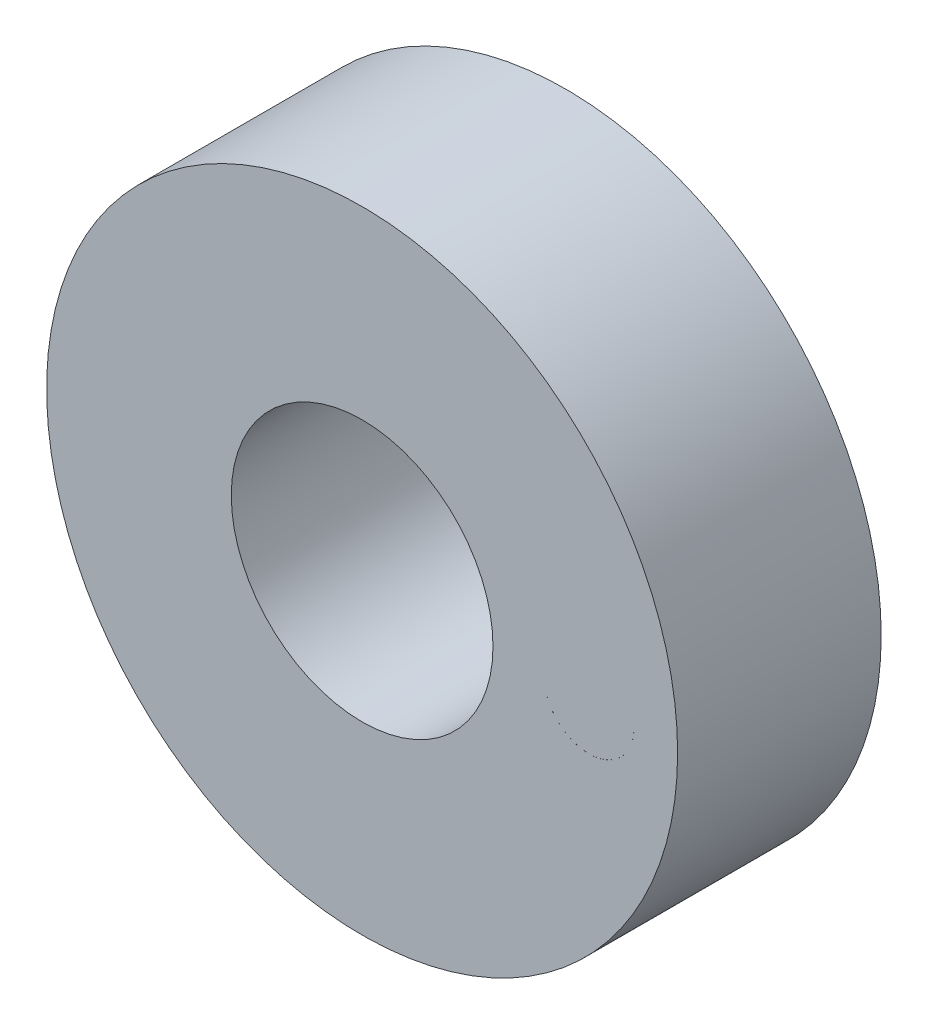
ISO-10303-21;
HEADER;
FILE_DESCRIPTION(('STEP AP214'),'2;1');
FILE_NAME('part.step','',(''),(''),'','','');
FILE_SCHEMA(('AUTOMOTIVE_DESIGN { 1 0 10303 214 1 1 1 1 }'));
ENDSEC;
DATA;
#1=APPLICATION_CONTEXT('core data for automotive mechanical design processes');
#2=APPLICATION_PROTOCOL_DEFINITION('international standard','automotive_design',2000,#1);
#3=PRODUCT_CONTEXT('',#1,'mechanical');
#4=PRODUCT('Part','Part','',(#3));
#5=PRODUCT_RELATED_PRODUCT_CATEGORY('part','',(#4));
#6=PRODUCT_DEFINITION_FORMATION('','',#4);
#7=PRODUCT_DEFINITION_CONTEXT('part definition',#1,'design');
#8=PRODUCT_DEFINITION('design','',#6,#7);
#9=PRODUCT_DEFINITION_SHAPE('','',#8);
#10=(LENGTH_UNIT() NAMED_UNIT(*) SI_UNIT(.MILLI.,.METRE.));
#11=(NAMED_UNIT(*) PLANE_ANGLE_UNIT() SI_UNIT($,.RADIAN.));
#12=(NAMED_UNIT(*) SI_UNIT($,.STERADIAN.) SOLID_ANGLE_UNIT());
#13=UNCERTAINTY_MEASURE_WITH_UNIT(LENGTH_MEASURE(1.E-05),#10,'distance_accuracy_value','');
#14=(GEOMETRIC_REPRESENTATION_CONTEXT(3) GLOBAL_UNCERTAINTY_ASSIGNED_CONTEXT((#13)) GLOBAL_UNIT_ASSIGNED_CONTEXT((#10,
#11,#12)) REPRESENTATION_CONTEXT('',''));
#15=CARTESIAN_POINT('',(0.,0.,0.));
#16=DIRECTION('',(0.,0.,1.));
#17=DIRECTION('',(1.,0.,0.));
#18=AXIS2_PLACEMENT_3D('',#15,#16,#17);
#19=CARTESIAN_POINT('',(0.,-7.79999999999999,7.));
#20=DIRECTION('',(0.,0.,-1.));
#21=DIRECTION('',(-1.,0.,0.));
#22=AXIS2_PLACEMENT_3D('',#19,#20,#21);
#23=CYLINDRICAL_SURFACE('',#22,1.54999999999988);
#24=CARTESIAN_POINT('',(0.,-7.79999999999999,0.));
#25=DIRECTION('',(0.,0.,1.));
#26=DIRECTION('',(1.,0.,0.));
#27=AXIS2_PLACEMENT_3D('',#24,#25,#26);
#28=CIRCLE('',#27,1.54999999999988);
#29=CARTESIAN_POINT('',(1.54999999999984,-7.79999999999999,0.));
#30=VERTEX_POINT('',#29);
#31=EDGE_CURVE('E94',#30,#30,#28,.T.);
#32=ORIENTED_EDGE('',*,*,#31,.F.);
#33=EDGE_LOOP('',(#32));
#34=FACE_BOUND('',#33,.T.);
#35=CARTESIAN_POINT('',(0.,-7.79999999999999,4.));
#36=DIRECTION('',(0.,0.,1.));
#37=DIRECTION('',(1.,0.,0.));
#38=AXIS2_PLACEMENT_3D('',#35,#36,#37);
#39=CIRCLE('',#38,1.54999999999988);
#40=CARTESIAN_POINT('',(1.54999999999984,-7.79999999999999,4.));
#41=VERTEX_POINT('',#40);
#42=EDGE_CURVE('E165',#41,#41,#39,.T.);
#43=ORIENTED_EDGE('',*,*,#42,.T.);
#44=EDGE_LOOP('',(#43));
#45=FACE_BOUND('',#44,.T.);
#46=ADVANCED_FACE('F45',(#34,#45),#23,.F.);
#47=CARTESIAN_POINT('',(-7.80000000000021,2.56630654227319E-13,7.));
#48=DIRECTION('',(0.,0.,-1.));
#49=DIRECTION('',(-1.,0.,0.));
#50=AXIS2_PLACEMENT_3D('',#47,#48,#49);
#51=CYLINDRICAL_SURFACE('',#50,1.55);
#52=CARTESIAN_POINT('',(-7.80000000000021,2.56630654227319E-13,0.));
#53=DIRECTION('',(0.,0.,1.));
#54=DIRECTION('',(1.,0.,0.));
#55=AXIS2_PLACEMENT_3D('',#52,#53,#54);
#56=CIRCLE('',#55,1.55);
#57=CARTESIAN_POINT('',(-6.25000000000021,2.56630654227319E-13,0.));
#58=VERTEX_POINT('',#57);
#59=EDGE_CURVE('E91',#58,#58,#56,.T.);
#60=ORIENTED_EDGE('',*,*,#59,.F.);
#61=EDGE_LOOP('',(#60));
#62=FACE_BOUND('',#61,.T.);
#63=CARTESIAN_POINT('',(-7.80000000000023,2.50667542278649E-13,4.));
#64=DIRECTION('',(0.,0.,1.));
#65=DIRECTION('',(1.,0.,0.));
#66=AXIS2_PLACEMENT_3D('',#63,#64,#65);
#67=CIRCLE('',#66,1.55);
#68=CARTESIAN_POINT('',(-6.25000000000023,2.50667542278649E-13,4.));
#69=VERTEX_POINT('',#68);
#70=EDGE_CURVE('E167',#69,#69,#67,.T.);
#71=ORIENTED_EDGE('',*,*,#70,.T.);
#72=EDGE_LOOP('',(#71));
#73=FACE_BOUND('',#72,.T.);
#74=ADVANCED_FACE('F139',(#62,#73),#51,.F.);
#75=CARTESIAN_POINT('',(0.,7.80000000000043,7.));
#76=DIRECTION('',(0.,0.,-1.));
#77=DIRECTION('',(-1.,0.,0.));
#78=AXIS2_PLACEMENT_3D('',#75,#76,#77);
#79=CYLINDRICAL_SURFACE('',#78,1.55000000000028);
#80=CARTESIAN_POINT('',(0.,7.80000000000043,0.));
#81=DIRECTION('',(0.,0.,1.));
#82=DIRECTION('',(1.,0.,0.));
#83=AXIS2_PLACEMENT_3D('',#80,#81,#82);
#84=CIRCLE('',#83,1.55000000000028);
#85=CARTESIAN_POINT('',(1.55000000000032,7.80000000000043,0.));
#86=VERTEX_POINT('',#85);
#87=EDGE_CURVE('E88',#86,#86,#84,.T.);
#88=ORIENTED_EDGE('',*,*,#87,.F.);
#89=EDGE_LOOP('',(#88));
#90=FACE_BOUND('',#89,.T.);
#91=CARTESIAN_POINT('',(0.,7.80000000000043,4.));
#92=DIRECTION('',(0.,0.,1.));
#93=DIRECTION('',(1.,0.,0.));
#94=AXIS2_PLACEMENT_3D('',#91,#92,#93);
#95=CIRCLE('',#94,1.55000000000028);
#96=CARTESIAN_POINT('',(1.55000000000032,7.80000000000043,4.));
#97=VERTEX_POINT('',#96);
#98=EDGE_CURVE('E99',#97,#97,#95,.T.);
#99=ORIENTED_EDGE('',*,*,#98,.T.);
#100=EDGE_LOOP('',(#99));
#101=FACE_BOUND('',#100,.T.);
#102=ADVANCED_FACE('F136',(#90,#101),#79,.F.);
#103=CARTESIAN_POINT('',(0.,0.,7.));
#104=DIRECTION('',(0.,0.,1.));
#105=DIRECTION('',(1.,0.,0.));
#106=AXIS2_PLACEMENT_3D('',#103,#104,#105);
#107=PLANE('',#106);
#108=CARTESIAN_POINT('',(7.80000000000021,1.84487063980702E-13,7.));
#109=DIRECTION('',(0.,0.,1.));
#110=DIRECTION('',(1.,0.,0.));
#111=AXIS2_PLACEMENT_3D('',#108,#109,#110);
#112=CIRCLE('',#111,1.55000000000015);
#113=CARTESIAN_POINT('',(6.25000017357694,0.000733545011808529,7.));
#114=VERTEX_POINT('',#113);
#115=CARTESIAN_POINT('',(9.34999974137716,0.000895394798641488,7.));
#116=VERTEX_POINT('',#115);
#117=EDGE_CURVE('E49',#114,#116,#112,.T.);
#118=ORIENTED_EDGE('',*,*,#117,.F.);
#119=CARTESIAN_POINT('',(7.79999991495389,0.00162893978756899,7.));
#120=DIRECTION('',(0.,0.,1.));
#121=DIRECTION('',(1.,0.,0.));
#122=AXIS2_PLACEMENT_3D('',#119,#120,#121);
#123=CIRCLE('',#122,1.55000000000013);
#124=EDGE_CURVE('E74',#114,#116,#123,.T.);
#125=ORIENTED_EDGE('',*,*,#124,.T.);
#126=EDGE_LOOP('',(#118,#125));
#127=FACE_BOUND('',#126,.T.);
#128=CARTESIAN_POINT('',(0.,0.,7.));
#129=DIRECTION('',(0.,0.,1.));
#130=DIRECTION('',(1.,0.,0.));
#131=AXIS2_PLACEMENT_3D('',#128,#129,#130);
#132=CIRCLE('',#131,10.85);
#133=CARTESIAN_POINT('',(10.85,0.,7.));
#134=VERTEX_POINT('',#133);
#135=EDGE_CURVE('E112',#134,#134,#132,.T.);
#136=ORIENTED_EDGE('',*,*,#135,.T.);
#137=EDGE_LOOP('',(#136));
#138=FACE_BOUND('',#137,.T.);
#139=CARTESIAN_POINT('',(0.,0.,7.));
#140=DIRECTION('',(0.,0.,1.));
#141=DIRECTION('',(1.,0.,0.));
#142=AXIS2_PLACEMENT_3D('',#139,#140,#141);
#143=CIRCLE('',#142,4.5);
#144=CARTESIAN_POINT('',(4.5,0.,7.));
#145=VERTEX_POINT('',#144);
#146=EDGE_CURVE('E106',#145,#145,#143,.T.);
#147=ORIENTED_EDGE('',*,*,#146,.F.);
#148=EDGE_LOOP('',(#147));
#149=FACE_BOUND('',#148,.T.);
#150=ADVANCED_FACE('F86',(#127,#138,#149),#107,.T.);
#151=CARTESIAN_POINT('',(0.,0.,0.));
#152=DIRECTION('',(0.,0.,1.));
#153=DIRECTION('',(1.,0.,0.));
#154=AXIS2_PLACEMENT_3D('',#151,#152,#153);
#155=PLANE('',#154);
#156=CARTESIAN_POINT('',(0.,0.,0.));
#157=DIRECTION('',(0.,0.,1.));
#158=DIRECTION('',(1.,0.,0.));
#159=AXIS2_PLACEMENT_3D('',#156,#157,#158);
#160=CIRCLE('',#159,10.85);
#161=CARTESIAN_POINT('',(10.85,0.,0.));
#162=VERTEX_POINT('',#161);
#163=EDGE_CURVE('E109',#162,#162,#160,.T.);
#164=ORIENTED_EDGE('',*,*,#163,.F.);
#165=EDGE_LOOP('',(#164));
#166=FACE_BOUND('',#165,.T.);
#167=CARTESIAN_POINT('',(0.,0.,0.));
#168=DIRECTION('',(0.,0.,1.));
#169=DIRECTION('',(1.,0.,0.));
#170=AXIS2_PLACEMENT_3D('',#167,#168,#169);
#171=CIRCLE('',#170,4.5);
#172=CARTESIAN_POINT('',(4.5,0.,0.));
#173=VERTEX_POINT('',#172);
#174=EDGE_CURVE('E105',#173,#173,#171,.T.);
#175=ORIENTED_EDGE('',*,*,#174,.T.);
#176=EDGE_LOOP('',(#175));
#177=FACE_BOUND('',#176,.T.);
#178=ORIENTED_EDGE('',*,*,#59,.T.);
#179=EDGE_LOOP('',(#178));
#180=FACE_BOUND('',#179,.T.);
#181=ORIENTED_EDGE('',*,*,#87,.T.);
#182=EDGE_LOOP('',(#181));
#183=FACE_BOUND('',#182,.T.);
#184=CARTESIAN_POINT('',(7.80000000000021,1.84487063980702E-13,0.));
#185=DIRECTION('',(0.,0.,1.));
#186=DIRECTION('',(1.,0.,0.));
#187=AXIS2_PLACEMENT_3D('',#184,#185,#186);
#188=CIRCLE('',#187,1.55000000000015);
#189=CARTESIAN_POINT('',(9.35000000000035,1.84487063980702E-13,0.));
#190=VERTEX_POINT('',#189);
#191=EDGE_CURVE('E89',#190,#190,#188,.T.);
#192=ORIENTED_EDGE('',*,*,#191,.T.);
#193=EDGE_LOOP('',(#192));
#194=FACE_BOUND('',#193,.T.);
#195=ORIENTED_EDGE('',*,*,#31,.T.);
#196=EDGE_LOOP('',(#195));
#197=FACE_BOUND('',#196,.T.);
#198=ADVANCED_FACE('F148',(#166,#177,#180,#183,#194,#197),#155,.F.);
#199=CARTESIAN_POINT('',(0.,0.,7.));
#200=DIRECTION('',(0.,0.,-1.));
#201=DIRECTION('',(-1.,0.,0.));
#202=AXIS2_PLACEMENT_3D('',#199,#200,#201);
#203=CYLINDRICAL_SURFACE('',#202,10.85);
#204=ORIENTED_EDGE('',*,*,#135,.F.);
#205=EDGE_LOOP('',(#204));
#206=FACE_BOUND('',#205,.T.);
#207=ORIENTED_EDGE('',*,*,#163,.T.);
#208=EDGE_LOOP('',(#207));
#209=FACE_BOUND('',#208,.T.);
#210=ADVANCED_FACE('F47',(#206,#209),#203,.T.);
#211=CARTESIAN_POINT('',(0.,0.,7.));
#212=DIRECTION('',(0.,0.,-1.));
#213=DIRECTION('',(-1.,0.,0.));
#214=AXIS2_PLACEMENT_3D('',#211,#212,#213);
#215=CYLINDRICAL_SURFACE('',#214,4.5);
#216=ORIENTED_EDGE('',*,*,#146,.T.);
#217=EDGE_LOOP('',(#216));
#218=FACE_BOUND('',#217,.T.);
#219=ORIENTED_EDGE('',*,*,#174,.F.);
#220=EDGE_LOOP('',(#219));
#221=FACE_BOUND('',#220,.T.);
#222=ADVANCED_FACE('F134',(#218,#221),#215,.F.);
#223=CARTESIAN_POINT('',(7.80000000000021,1.84487063980702E-13,7.));
#224=DIRECTION('',(0.,0.,-1.));
#225=DIRECTION('',(-1.,0.,0.));
#226=AXIS2_PLACEMENT_3D('',#223,#224,#225);
#227=CYLINDRICAL_SURFACE('',#226,1.55000000000015);
#228=DIRECTION('',(0.,0.,1.));
#229=VECTOR('',#228,1.);
#230=CARTESIAN_POINT('',(9.34999974137716,0.000895394798641488,5.5));
#231=LINE('',#230,#229);
#232=CARTESIAN_POINT('',(9.34999974137716,0.000895394798641488,4.));
#233=VERTEX_POINT('',#232);
#234=EDGE_CURVE('E13',#233,#116,#231,.T.);
#235=ORIENTED_EDGE('',*,*,#234,.F.);
#236=CARTESIAN_POINT('',(7.80000000000021,1.84487063980702E-13,4.));
#237=DIRECTION('',(0.,0.,1.));
#238=DIRECTION('',(0.999999833146324,0.000577674063520457,0.));
#239=AXIS2_PLACEMENT_3D('',#236,#237,#238);
#240=CIRCLE('',#239,1.55000000000015);
#241=CARTESIAN_POINT('',(6.25000017357694,0.000733545011808529,4.));
#242=VERTEX_POINT('',#241);
#243=EDGE_CURVE('E66',#233,#242,#240,.T.);
#244=ORIENTED_EDGE('',*,*,#243,.T.);
#245=DIRECTION('',(0.,0.,1.));
#246=VECTOR('',#245,1.);
#247=CARTESIAN_POINT('',(6.25000017357694,0.000733545011808529,5.5));
#248=LINE('',#247,#246);
#249=EDGE_CURVE('E55',#114,#242,#248,.F.);
#250=ORIENTED_EDGE('',*,*,#249,.F.);
#251=ORIENTED_EDGE('',*,*,#117,.T.);
#252=EDGE_LOOP('',(#235,#244,#250,#251));
#253=FACE_BOUND('',#252,.T.);
#254=ORIENTED_EDGE('',*,*,#191,.F.);
#255=EDGE_LOOP('',(#254));
#256=FACE_BOUND('',#255,.T.);
#257=ADVANCED_FACE('F83',(#253,#256),#227,.F.);
#258=CARTESIAN_POINT('',(0.,7.80000000000043,4.));
#259=DIRECTION('',(0.,0.,1.));
#260=DIRECTION('',(1.,0.,0.));
#261=AXIS2_PLACEMENT_3D('',#258,#259,#260);
#262=PLANE('',#261);
#263=ORIENTED_EDGE('',*,*,#98,.F.);
#264=EDGE_LOOP('',(#263));
#265=FACE_BOUND('',#264,.T.);
#266=ADVANCED_FACE('F133',(#265),#262,.F.);
#267=CARTESIAN_POINT('',(-7.80000000000023,2.50667542278649E-13,4.));
#268=DIRECTION('',(0.,0.,1.));
#269=DIRECTION('',(1.,0.,0.));
#270=AXIS2_PLACEMENT_3D('',#267,#268,#269);
#271=PLANE('',#270);
#272=ORIENTED_EDGE('',*,*,#70,.F.);
#273=EDGE_LOOP('',(#272));
#274=FACE_BOUND('',#273,.T.);
#275=ADVANCED_FACE('F180',(#274),#271,.F.);
#276=CARTESIAN_POINT('',(0.,-7.79999999999999,4.));
#277=DIRECTION('',(0.,0.,1.));
#278=DIRECTION('',(1.,0.,0.));
#279=AXIS2_PLACEMENT_3D('',#276,#277,#278);
#280=PLANE('',#279);
#281=ORIENTED_EDGE('',*,*,#42,.F.);
#282=EDGE_LOOP('',(#281));
#283=FACE_BOUND('',#282,.T.);
#284=ADVANCED_FACE('F184',(#283),#280,.F.);
#285=CARTESIAN_POINT('',(7.79999991495389,0.00162893978756899,4.));
#286=DIRECTION('',(0.,0.,1.));
#287=DIRECTION('',(1.,0.,0.));
#288=AXIS2_PLACEMENT_3D('',#285,#286,#287);
#289=PLANE('',#288);
#290=ORIENTED_EDGE('',*,*,#243,.F.);
#291=CARTESIAN_POINT('',(7.79999991495389,0.00162893978756899,4.));
#292=DIRECTION('',(0.,0.,1.));
#293=DIRECTION('',(1.,0.,0.));
#294=AXIS2_PLACEMENT_3D('',#291,#292,#293);
#295=CIRCLE('',#294,1.55000000000013);
#296=EDGE_CURVE('E62',#242,#233,#295,.T.);
#297=ORIENTED_EDGE('',*,*,#296,.F.);
#298=EDGE_LOOP('',(#290,#297));
#299=FACE_BOUND('',#298,.T.);
#300=ADVANCED_FACE('F190',(#299),#289,.F.);
#301=CARTESIAN_POINT('',(7.79999991495389,0.00162893978756899,4.));
#302=DIRECTION('',(0.,0.,1.));
#303=DIRECTION('',(1.,0.,0.));
#304=AXIS2_PLACEMENT_3D('',#301,#302,#303);
#305=CYLINDRICAL_SURFACE('',#304,1.55000000000013);
#306=ORIENTED_EDGE('',*,*,#296,.T.);
#307=ORIENTED_EDGE('',*,*,#234,.T.);
#308=ORIENTED_EDGE('',*,*,#124,.F.);
#309=ORIENTED_EDGE('',*,*,#249,.T.);
#310=EDGE_LOOP('',(#306,#307,#308,#309));
#311=FACE_BOUND('',#310,.T.);
#312=ADVANCED_FACE('F76',(#311),#305,.T.);
#313=CLOSED_SHELL('',(#46,#74,#102,#150,#198,#210,#222,#257,#266,#275,#284,#300,#312));
#314=MANIFOLD_SOLID_BREP('B2',#313);
#315=ADVANCED_BREP_SHAPE_REPRESENTATION('',(#18,#314),#14);
#316=SHAPE_DEFINITION_REPRESENTATION(#9,#315);
ENDSEC;
END-ISO-10303-21;
